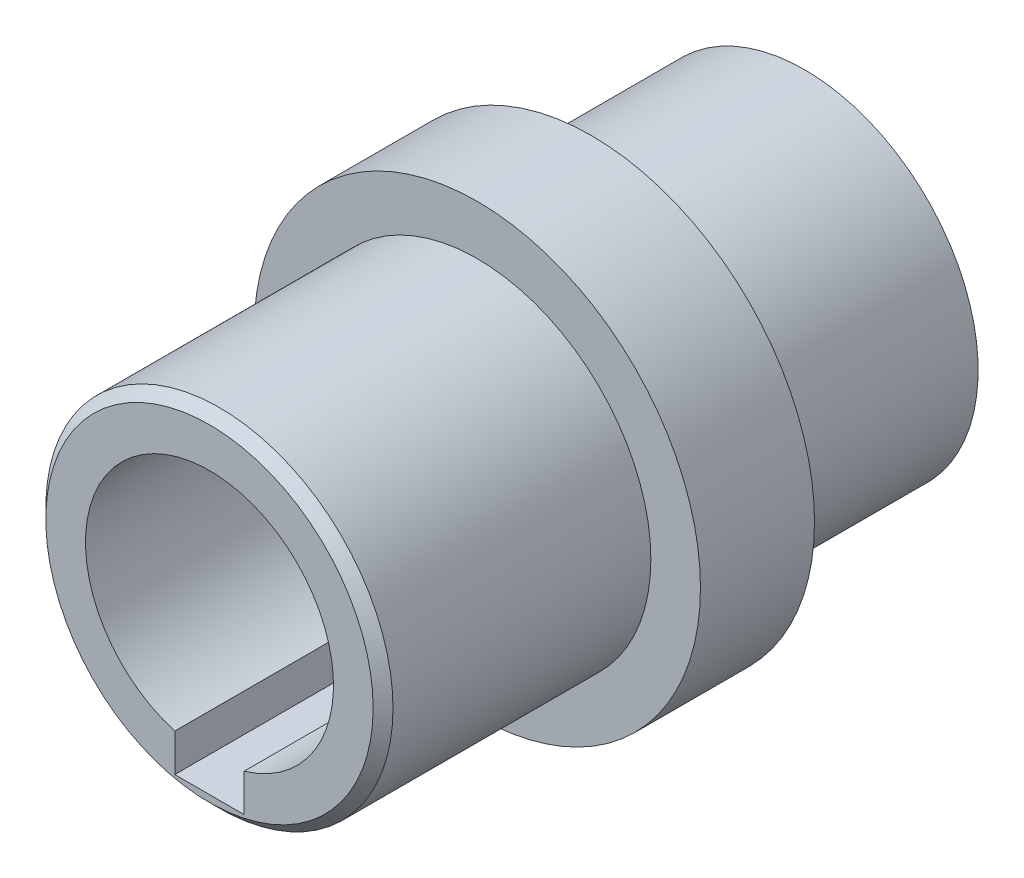
ISO-10303-21;
HEADER;
FILE_DESCRIPTION(('STEP AP214'),'2;1');
FILE_NAME('part.step','',(''),(''),'','','');
FILE_SCHEMA(('AUTOMOTIVE_DESIGN { 1 0 10303 214 1 1 1 1 }'));
ENDSEC;
DATA;
#1=APPLICATION_CONTEXT('core data for automotive mechanical design processes');
#2=APPLICATION_PROTOCOL_DEFINITION('international standard','automotive_design',2000,#1);
#3=PRODUCT_CONTEXT('',#1,'mechanical');
#4=PRODUCT('Part','Part','',(#3));
#5=PRODUCT_RELATED_PRODUCT_CATEGORY('part','',(#4));
#6=PRODUCT_DEFINITION_FORMATION('','',#4);
#7=PRODUCT_DEFINITION_CONTEXT('part definition',#1,'design');
#8=PRODUCT_DEFINITION('design','',#6,#7);
#9=PRODUCT_DEFINITION_SHAPE('','',#8);
#10=(LENGTH_UNIT() NAMED_UNIT(*) SI_UNIT(.MILLI.,.METRE.));
#11=(NAMED_UNIT(*) PLANE_ANGLE_UNIT() SI_UNIT($,.RADIAN.));
#12=(NAMED_UNIT(*) SI_UNIT($,.STERADIAN.) SOLID_ANGLE_UNIT());
#13=UNCERTAINTY_MEASURE_WITH_UNIT(LENGTH_MEASURE(1.E-05),#10,'distance_accuracy_value','');
#14=(GEOMETRIC_REPRESENTATION_CONTEXT(3) GLOBAL_UNCERTAINTY_ASSIGNED_CONTEXT((#13)) GLOBAL_UNIT_ASSIGNED_CONTEXT((#10,
#11,#12)) REPRESENTATION_CONTEXT('',''));
#15=CARTESIAN_POINT('',(0.,0.,0.));
#16=DIRECTION('',(0.,0.,1.));
#17=DIRECTION('',(1.,0.,0.));
#18=AXIS2_PLACEMENT_3D('',#15,#16,#17);
#19=CARTESIAN_POINT('',(0.,0.,60.));
#20=DIRECTION('',(0.,0.,-1.));
#21=DIRECTION('',(-1.,0.,0.));
#22=AXIS2_PLACEMENT_3D('',#19,#20,#21);
#23=CYLINDRICAL_SURFACE('',#22,22.5);
#24=CARTESIAN_POINT('',(0.,0.,33.));
#25=DIRECTION('',(0.,0.,1.));
#26=DIRECTION('',(1.,0.,0.));
#27=AXIS2_PLACEMENT_3D('',#24,#25,#26);
#28=CIRCLE('',#27,22.5);
#29=CARTESIAN_POINT('',(22.5,0.,33.));
#30=VERTEX_POINT('',#29);
#31=EDGE_CURVE('E116',#30,#30,#28,.T.);
#32=ORIENTED_EDGE('',*,*,#31,.F.);
#33=EDGE_LOOP('',(#32));
#34=FACE_BOUND('',#33,.T.);
#35=CARTESIAN_POINT('',(0.,0.,21.5));
#36=DIRECTION('',(0.,0.,-1.));
#37=DIRECTION('',(-1.,0.,0.));
#38=AXIS2_PLACEMENT_3D('',#35,#36,#37);
#39=CIRCLE('',#38,22.5);
#40=CARTESIAN_POINT('',(-22.5,0.,21.5));
#41=VERTEX_POINT('',#40);
#42=EDGE_CURVE('E110',#41,#41,#39,.T.);
#43=ORIENTED_EDGE('',*,*,#42,.F.);
#44=EDGE_LOOP('',(#43));
#45=FACE_BOUND('',#44,.T.);
#46=ADVANCED_FACE('F35',(#34,#45),#23,.T.);
#47=CARTESIAN_POINT('',(0.,0.,33.));
#48=DIRECTION('',(0.,0.,1.));
#49=DIRECTION('',(1.,0.,0.));
#50=AXIS2_PLACEMENT_3D('',#47,#48,#49);
#51=PLANE('',#50);
#52=CARTESIAN_POINT('',(0.,0.,33.));
#53=DIRECTION('',(0.,0.,1.));
#54=DIRECTION('',(1.,0.,0.));
#55=AXIS2_PLACEMENT_3D('',#52,#53,#54);
#56=CIRCLE('',#55,17.5);
#57=CARTESIAN_POINT('',(17.5,0.,33.));
#58=VERTEX_POINT('',#57);
#59=EDGE_CURVE('E113',#58,#58,#56,.T.);
#60=ORIENTED_EDGE('',*,*,#59,.F.);
#61=EDGE_LOOP('',(#60));
#62=FACE_BOUND('',#61,.T.);
#63=ORIENTED_EDGE('',*,*,#31,.T.);
#64=EDGE_LOOP('',(#63));
#65=FACE_BOUND('',#64,.T.);
#66=ADVANCED_FACE('F139',(#62,#65),#51,.T.);
#67=CARTESIAN_POINT('',(0.,0.,33.));
#68=DIRECTION('',(0.,0.,1.));
#69=DIRECTION('',(1.,0.,0.));
#70=AXIS2_PLACEMENT_3D('',#67,#68,#69);
#71=CYLINDRICAL_SURFACE('',#70,17.5);
#72=CARTESIAN_POINT('',(0.,0.,59.));
#73=DIRECTION('',(0.,0.,1.));
#74=DIRECTION('',(1.,0.,0.));
#75=AXIS2_PLACEMENT_3D('',#72,#73,#74);
#76=CIRCLE('',#75,17.5);
#77=CARTESIAN_POINT('',(17.5,0.,59.));
#78=VERTEX_POINT('',#77);
#79=EDGE_CURVE('E12',#78,#78,#76,.F.);
#80=ORIENTED_EDGE('',*,*,#79,.T.);
#81=EDGE_LOOP('',(#80));
#82=FACE_BOUND('',#81,.T.);
#83=ORIENTED_EDGE('',*,*,#59,.T.);
#84=EDGE_LOOP('',(#83));
#85=FACE_BOUND('',#84,.T.);
#86=ADVANCED_FACE('F144',(#82,#85),#71,.T.);
#87=CARTESIAN_POINT('',(0.,0.,60.));
#88=DIRECTION('',(0.,0.,1.));
#89=DIRECTION('',(1.,0.,0.));
#90=AXIS2_PLACEMENT_3D('',#87,#88,#89);
#91=PLANE('',#90);
#92=CARTESIAN_POINT('',(0.,0.,60.));
#93=DIRECTION('',(0.,0.,1.));
#94=DIRECTION('',(1.,0.,0.));
#95=AXIS2_PLACEMENT_3D('',#92,#93,#94);
#96=CIRCLE('',#95,16.5);
#97=CARTESIAN_POINT('',(16.5,0.,60.));
#98=VERTEX_POINT('',#97);
#99=EDGE_CURVE('E43',#98,#98,#96,.T.);
#100=ORIENTED_EDGE('',*,*,#99,.T.);
#101=EDGE_LOOP('',(#100));
#102=FACE_BOUND('',#101,.T.);
#103=DIRECTION('',(0.,-1.,0.));
#104=VECTOR('',#103,1.);
#105=CARTESIAN_POINT('',(-3.5,0.,60.));
#106=LINE('',#105,#104);
#107=CARTESIAN_POINT('',(-3.5,-12.,60.));
#108=VERTEX_POINT('',#107);
#109=CARTESIAN_POINT('',(-3.5,-15.8,60.));
#110=VERTEX_POINT('',#109);
#111=EDGE_CURVE('E87',#108,#110,#106,.T.);
#112=ORIENTED_EDGE('',*,*,#111,.F.);
#113=CARTESIAN_POINT('',(0.,0.,60.));
#114=DIRECTION('',(0.,0.,1.));
#115=DIRECTION('',(1.,0.,0.));
#116=AXIS2_PLACEMENT_3D('',#113,#114,#115);
#117=CIRCLE('',#116,12.5);
#118=CARTESIAN_POINT('',(3.5,-12.,60.));
#119=VERTEX_POINT('',#118);
#120=EDGE_CURVE('E86',#119,#108,#117,.T.);
#121=ORIENTED_EDGE('',*,*,#120,.F.);
#122=DIRECTION('',(0.,1.,0.));
#123=VECTOR('',#122,1.);
#124=CARTESIAN_POINT('',(3.5,0.,60.));
#125=LINE('',#124,#123);
#126=CARTESIAN_POINT('',(3.5,-15.8,60.));
#127=VERTEX_POINT('',#126);
#128=EDGE_CURVE('E50',#127,#119,#125,.T.);
#129=ORIENTED_EDGE('',*,*,#128,.F.);
#130=DIRECTION('',(-1.,0.,0.));
#131=VECTOR('',#130,1.);
#132=CARTESIAN_POINT('',(0.,-15.8,60.));
#133=LINE('',#132,#131);
#134=EDGE_CURVE('E79',#127,#110,#133,.T.);
#135=ORIENTED_EDGE('',*,*,#134,.T.);
#136=EDGE_LOOP('',(#112,#121,#129,#135));
#137=FACE_BOUND('',#136,.T.);
#138=ADVANCED_FACE('F94',(#102,#137),#91,.T.);
#139=CARTESIAN_POINT('',(0.,0.,21.5));
#140=DIRECTION('',(0.,0.,-1.));
#141=DIRECTION('',(-1.,0.,0.));
#142=AXIS2_PLACEMENT_3D('',#139,#140,#141);
#143=PLANE('',#142);
#144=CARTESIAN_POINT('',(0.,0.,21.5));
#145=DIRECTION('',(0.,0.,-1.));
#146=DIRECTION('',(-1.,0.,0.));
#147=AXIS2_PLACEMENT_3D('',#144,#145,#146);
#148=CIRCLE('',#147,17.5);
#149=CARTESIAN_POINT('',(-17.5,0.,21.5));
#150=VERTEX_POINT('',#149);
#151=EDGE_CURVE('E107',#150,#150,#148,.T.);
#152=ORIENTED_EDGE('',*,*,#151,.F.);
#153=EDGE_LOOP('',(#152));
#154=FACE_BOUND('',#153,.T.);
#155=ORIENTED_EDGE('',*,*,#42,.T.);
#156=EDGE_LOOP('',(#155));
#157=FACE_BOUND('',#156,.T.);
#158=ADVANCED_FACE('F157',(#154,#157),#143,.T.);
#159=CARTESIAN_POINT('',(0.,0.,21.5));
#160=DIRECTION('',(0.,0.,-1.));
#161=DIRECTION('',(-1.,0.,0.));
#162=AXIS2_PLACEMENT_3D('',#159,#160,#161);
#163=CYLINDRICAL_SURFACE('',#162,17.5);
#164=ORIENTED_EDGE('',*,*,#151,.T.);
#165=EDGE_LOOP('',(#164));
#166=FACE_BOUND('',#165,.T.);
#167=CARTESIAN_POINT('',(0.,0.,0.));
#168=DIRECTION('',(0.,0.,-1.));
#169=DIRECTION('',(-1.,0.,0.));
#170=AXIS2_PLACEMENT_3D('',#167,#168,#169);
#171=CIRCLE('',#170,17.5);
#172=CARTESIAN_POINT('',(-17.5,0.,0.));
#173=VERTEX_POINT('',#172);
#174=EDGE_CURVE('E105',#173,#173,#171,.T.);
#175=ORIENTED_EDGE('',*,*,#174,.F.);
#176=EDGE_LOOP('',(#175));
#177=FACE_BOUND('',#176,.T.);
#178=ADVANCED_FACE('F154',(#166,#177),#163,.T.);
#179=CARTESIAN_POINT('',(0.,0.,0.));
#180=DIRECTION('',(0.,0.,1.));
#181=DIRECTION('',(1.,0.,0.));
#182=AXIS2_PLACEMENT_3D('',#179,#180,#181);
#183=PLANE('',#182);
#184=CARTESIAN_POINT('',(0.,0.,0.));
#185=DIRECTION('',(0.,0.,1.));
#186=DIRECTION('',(1.,0.,0.));
#187=AXIS2_PLACEMENT_3D('',#184,#185,#186);
#188=CIRCLE('',#187,12.5);
#189=CARTESIAN_POINT('',(3.5,-12.,0.));
#190=VERTEX_POINT('',#189);
#191=CARTESIAN_POINT('',(-3.5,-12.,0.));
#192=VERTEX_POINT('',#191);
#193=EDGE_CURVE('E102',#190,#192,#188,.T.);
#194=ORIENTED_EDGE('',*,*,#193,.T.);
#195=DIRECTION('',(0.,-1.,0.));
#196=VECTOR('',#195,1.);
#197=CARTESIAN_POINT('',(-3.5,0.,0.));
#198=LINE('',#197,#196);
#199=CARTESIAN_POINT('',(-3.5,-15.8,0.));
#200=VERTEX_POINT('',#199);
#201=EDGE_CURVE('E58',#192,#200,#198,.T.);
#202=ORIENTED_EDGE('',*,*,#201,.T.);
#203=DIRECTION('',(-1.,0.,0.));
#204=VECTOR('',#203,1.);
#205=CARTESIAN_POINT('',(0.,-15.8,0.));
#206=LINE('',#205,#204);
#207=CARTESIAN_POINT('',(3.5,-15.8,0.));
#208=VERTEX_POINT('',#207);
#209=EDGE_CURVE('E125',#208,#200,#206,.T.);
#210=ORIENTED_EDGE('',*,*,#209,.F.);
#211=DIRECTION('',(0.,1.,0.));
#212=VECTOR('',#211,1.);
#213=CARTESIAN_POINT('',(3.5,0.,0.));
#214=LINE('',#213,#212);
#215=EDGE_CURVE('E91',#208,#190,#214,.T.);
#216=ORIENTED_EDGE('',*,*,#215,.T.);
#217=EDGE_LOOP('',(#194,#202,#210,#216));
#218=FACE_BOUND('',#217,.T.);
#219=ORIENTED_EDGE('',*,*,#174,.T.);
#220=EDGE_LOOP('',(#219));
#221=FACE_BOUND('',#220,.T.);
#222=ADVANCED_FACE('F150',(#218,#221),#183,.F.);
#223=CARTESIAN_POINT('',(0.,0.,0.));
#224=DIRECTION('',(0.,0.,1.));
#225=DIRECTION('',(1.,0.,0.));
#226=AXIS2_PLACEMENT_3D('',#223,#224,#225);
#227=CYLINDRICAL_SURFACE('',#226,12.5);
#228=ORIENTED_EDGE('',*,*,#120,.T.);
#229=DIRECTION('',(0.,0.,1.));
#230=VECTOR('',#229,1.);
#231=CARTESIAN_POINT('',(-3.5,-12.,0.));
#232=LINE('',#231,#230);
#233=EDGE_CURVE('E123',#108,#192,#232,.F.);
#234=ORIENTED_EDGE('',*,*,#233,.T.);
#235=ORIENTED_EDGE('',*,*,#193,.F.);
#236=DIRECTION('',(0.,0.,1.));
#237=VECTOR('',#236,1.);
#238=CARTESIAN_POINT('',(3.5,-12.,0.));
#239=LINE('',#238,#237);
#240=EDGE_CURVE('E119',#190,#119,#239,.T.);
#241=ORIENTED_EDGE('',*,*,#240,.T.);
#242=EDGE_LOOP('',(#228,#234,#235,#241));
#243=FACE_BOUND('',#242,.T.);
#244=ADVANCED_FACE('F153',(#243),#227,.F.);
#245=CARTESIAN_POINT('',(0.,-15.8,132.654252639156));
#246=DIRECTION('',(0.,1.,0.));
#247=DIRECTION('',(0.,0.,1.));
#248=AXIS2_PLACEMENT_3D('',#245,#246,#247);
#249=PLANE('',#248);
#250=DIRECTION('',(0.,0.,-1.));
#251=VECTOR('',#250,1.);
#252=CARTESIAN_POINT('',(3.5,-15.8,132.654252639156));
#253=LINE('',#252,#251);
#254=EDGE_CURVE('E81',#127,#208,#253,.T.);
#255=ORIENTED_EDGE('',*,*,#254,.T.);
#256=ORIENTED_EDGE('',*,*,#209,.T.);
#257=DIRECTION('',(0.,0.,1.));
#258=VECTOR('',#257,1.);
#259=CARTESIAN_POINT('',(-3.5,-15.8,132.654252639156));
#260=LINE('',#259,#258);
#261=EDGE_CURVE('E83',#200,#110,#260,.T.);
#262=ORIENTED_EDGE('',*,*,#261,.T.);
#263=ORIENTED_EDGE('',*,*,#134,.F.);
#264=EDGE_LOOP('',(#255,#256,#262,#263));
#265=FACE_BOUND('',#264,.T.);
#266=ADVANCED_FACE('F80',(#265),#249,.T.);
#267=CARTESIAN_POINT('',(-3.5,-15.8,132.654252639156));
#268=DIRECTION('',(-1.,0.,0.));
#269=DIRECTION('',(0.,0.,1.));
#270=AXIS2_PLACEMENT_3D('',#267,#268,#269);
#271=PLANE('',#270);
#272=ORIENTED_EDGE('',*,*,#111,.T.);
#273=ORIENTED_EDGE('',*,*,#261,.F.);
#274=ORIENTED_EDGE('',*,*,#201,.F.);
#275=ORIENTED_EDGE('',*,*,#233,.F.);
#276=EDGE_LOOP('',(#272,#273,#274,#275));
#277=FACE_BOUND('',#276,.T.);
#278=ADVANCED_FACE('F135',(#277),#271,.F.);
#279=CARTESIAN_POINT('',(3.5,-15.8,132.654252639156));
#280=DIRECTION('',(1.,0.,0.));
#281=DIRECTION('',(0.,0.,-1.));
#282=AXIS2_PLACEMENT_3D('',#279,#280,#281);
#283=PLANE('',#282);
#284=ORIENTED_EDGE('',*,*,#128,.T.);
#285=ORIENTED_EDGE('',*,*,#240,.F.);
#286=ORIENTED_EDGE('',*,*,#215,.F.);
#287=ORIENTED_EDGE('',*,*,#254,.F.);
#288=EDGE_LOOP('',(#284,#285,#286,#287));
#289=FACE_BOUND('',#288,.T.);
#290=ADVANCED_FACE('F89',(#289),#283,.F.);
#291=CARTESIAN_POINT('',(0.,0.,60.));
#292=DIRECTION('',(0.,0.,-1.));
#293=DIRECTION('',(-1.,0.,0.));
#294=AXIS2_PLACEMENT_3D('',#291,#292,#293);
#295=CONICAL_SURFACE('',#294,16.5,0.78539816339745);
#296=ORIENTED_EDGE('',*,*,#79,.F.);
#297=EDGE_LOOP('',(#296));
#298=FACE_BOUND('',#297,.T.);
#299=ORIENTED_EDGE('',*,*,#99,.F.);
#300=EDGE_LOOP('',(#299));
#301=FACE_BOUND('',#300,.T.);
#302=ADVANCED_FACE('F37',(#298,#301),#295,.T.);
#303=CLOSED_SHELL('',(#46,#66,#86,#138,#158,#178,#222,#244,#266,#278,#290,#302));
#304=MANIFOLD_SOLID_BREP('B2',#303);
#305=ADVANCED_BREP_SHAPE_REPRESENTATION('',(#18,#304),#14);
#306=SHAPE_DEFINITION_REPRESENTATION(#9,#305);
ENDSEC;
END-ISO-10303-21;
